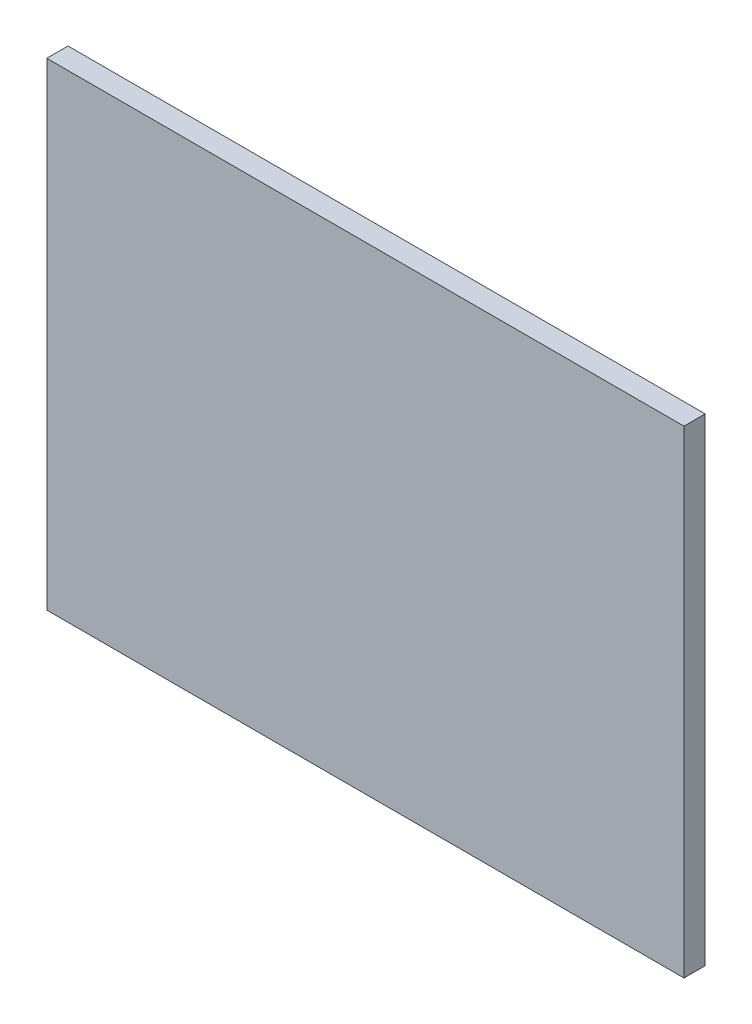
ISO-10303-21;
HEADER;
FILE_DESCRIPTION(('STEP AP214'),'2;1');
FILE_NAME('part.step','',(''),(''),'','','');
FILE_SCHEMA(('AUTOMOTIVE_DESIGN { 1 0 10303 214 1 1 1 1 }'));
ENDSEC;
DATA;
#1=APPLICATION_CONTEXT('core data for automotive mechanical design processes');
#2=APPLICATION_PROTOCOL_DEFINITION('international standard','automotive_design',2000,#1);
#3=PRODUCT_CONTEXT('',#1,'mechanical');
#4=PRODUCT('Part','Part','',(#3));
#5=PRODUCT_RELATED_PRODUCT_CATEGORY('part','',(#4));
#6=PRODUCT_DEFINITION_FORMATION('','',#4);
#7=PRODUCT_DEFINITION_CONTEXT('part definition',#1,'design');
#8=PRODUCT_DEFINITION('design','',#6,#7);
#9=PRODUCT_DEFINITION_SHAPE('','',#8);
#10=(LENGTH_UNIT() NAMED_UNIT(*) SI_UNIT(.MILLI.,.METRE.));
#11=(NAMED_UNIT(*) PLANE_ANGLE_UNIT() SI_UNIT($,.RADIAN.));
#12=(NAMED_UNIT(*) SI_UNIT($,.STERADIAN.) SOLID_ANGLE_UNIT());
#13=UNCERTAINTY_MEASURE_WITH_UNIT(LENGTH_MEASURE(1.E-05),#10,'distance_accuracy_value','');
#14=(GEOMETRIC_REPRESENTATION_CONTEXT(3) GLOBAL_UNCERTAINTY_ASSIGNED_CONTEXT((#13)) GLOBAL_UNIT_ASSIGNED_CONTEXT((#10,
#11,#12)) REPRESENTATION_CONTEXT('',''));
#15=CARTESIAN_POINT('',(0.,0.,0.));
#16=DIRECTION('',(0.,0.,1.));
#17=DIRECTION('',(1.,0.,0.));
#18=AXIS2_PLACEMENT_3D('',#15,#16,#17);
#19=CARTESIAN_POINT('',(0.,0.,0.));
#20=DIRECTION('',(1.,0.,0.));
#21=DIRECTION('',(0.,0.,1.));
#22=AXIS2_PLACEMENT_3D('',#19,#20,#21);
#23=PLANE('',#22);
#24=DIRECTION('',(0.,1.,0.));
#25=VECTOR('',#24,1.);
#26=CARTESIAN_POINT('',(0.,0.,0.06));
#27=LINE('',#26,#25);
#28=CARTESIAN_POINT('',(0.,0.,0.06));
#29=VERTEX_POINT('',#28);
#30=CARTESIAN_POINT('',(0.,1.35,0.06));
#31=VERTEX_POINT('',#30);
#32=EDGE_CURVE('E11',#29,#31,#27,.T.);
#33=ORIENTED_EDGE('',*,*,#32,.T.);
#34=DIRECTION('',(0.,0.,1.));
#35=VECTOR('',#34,1.);
#36=CARTESIAN_POINT('',(0.,1.35,0.));
#37=LINE('',#36,#35);
#38=CARTESIAN_POINT('',(0.,1.35,0.));
#39=VERTEX_POINT('',#38);
#40=EDGE_CURVE('E69',#39,#31,#37,.T.);
#41=ORIENTED_EDGE('',*,*,#40,.F.);
#42=DIRECTION('',(0.,1.,0.));
#43=VECTOR('',#42,1.);
#44=CARTESIAN_POINT('',(0.,0.,0.));
#45=LINE('',#44,#43);
#46=CARTESIAN_POINT('',(0.,0.,0.));
#47=VERTEX_POINT('',#46);
#48=EDGE_CURVE('E81',#47,#39,#45,.T.);
#49=ORIENTED_EDGE('',*,*,#48,.F.);
#50=DIRECTION('',(0.,0.,1.));
#51=VECTOR('',#50,1.);
#52=CARTESIAN_POINT('',(0.,0.,0.));
#53=LINE('',#52,#51);
#54=EDGE_CURVE('E64',#47,#29,#53,.T.);
#55=ORIENTED_EDGE('',*,*,#54,.T.);
#56=EDGE_LOOP('',(#33,#41,#49,#55));
#57=FACE_BOUND('',#56,.T.);
#58=ADVANCED_FACE('F17',(#57),#23,.F.);
#59=CARTESIAN_POINT('',(1.8,0.,0.));
#60=DIRECTION('',(1.,0.,0.));
#61=DIRECTION('',(0.,0.,1.));
#62=AXIS2_PLACEMENT_3D('',#59,#60,#61);
#63=PLANE('',#62);
#64=DIRECTION('',(0.,0.,1.));
#65=VECTOR('',#64,1.);
#66=CARTESIAN_POINT('',(1.8,0.,0.));
#67=LINE('',#66,#65);
#68=CARTESIAN_POINT('',(1.8,0.,0.));
#69=VERTEX_POINT('',#68);
#70=CARTESIAN_POINT('',(1.8,0.,0.06));
#71=VERTEX_POINT('',#70);
#72=EDGE_CURVE('E24',#69,#71,#67,.T.);
#73=ORIENTED_EDGE('',*,*,#72,.F.);
#74=DIRECTION('',(0.,1.,0.));
#75=VECTOR('',#74,1.);
#76=CARTESIAN_POINT('',(1.8,0.,0.));
#77=LINE('',#76,#75);
#78=CARTESIAN_POINT('',(1.8,1.35,0.));
#79=VERTEX_POINT('',#78);
#80=EDGE_CURVE('E59',#69,#79,#77,.T.);
#81=ORIENTED_EDGE('',*,*,#80,.T.);
#82=DIRECTION('',(0.,0.,1.));
#83=VECTOR('',#82,1.);
#84=CARTESIAN_POINT('',(1.8,1.35,0.));
#85=LINE('',#84,#83);
#86=CARTESIAN_POINT('',(1.8,1.35,0.06));
#87=VERTEX_POINT('',#86);
#88=EDGE_CURVE('E53',#79,#87,#85,.T.);
#89=ORIENTED_EDGE('',*,*,#88,.T.);
#90=DIRECTION('',(0.,1.,0.));
#91=VECTOR('',#90,1.);
#92=CARTESIAN_POINT('',(1.8,0.,0.06));
#93=LINE('',#92,#91);
#94=EDGE_CURVE('E57',#71,#87,#93,.T.);
#95=ORIENTED_EDGE('',*,*,#94,.F.);
#96=EDGE_LOOP('',(#73,#81,#89,#95));
#97=FACE_BOUND('',#96,.T.);
#98=ADVANCED_FACE('F55',(#97),#63,.T.);
#99=CARTESIAN_POINT('',(0.,0.,0.));
#100=DIRECTION('',(0.,1.,0.));
#101=DIRECTION('',(0.,0.,1.));
#102=AXIS2_PLACEMENT_3D('',#99,#100,#101);
#103=PLANE('',#102);
#104=ORIENTED_EDGE('',*,*,#72,.T.);
#105=DIRECTION('',(1.,0.,0.));
#106=VECTOR('',#105,1.);
#107=CARTESIAN_POINT('',(0.,0.,0.06));
#108=LINE('',#107,#106);
#109=EDGE_CURVE('E63',#29,#71,#108,.T.);
#110=ORIENTED_EDGE('',*,*,#109,.F.);
#111=ORIENTED_EDGE('',*,*,#54,.F.);
#112=DIRECTION('',(1.,0.,0.));
#113=VECTOR('',#112,1.);
#114=CARTESIAN_POINT('',(0.,0.,0.));
#115=LINE('',#114,#113);
#116=EDGE_CURVE('E71',#47,#69,#115,.T.);
#117=ORIENTED_EDGE('',*,*,#116,.T.);
#118=EDGE_LOOP('',(#104,#110,#111,#117));
#119=FACE_BOUND('',#118,.T.);
#120=ADVANCED_FACE('F87',(#119),#103,.F.);
#121=CARTESIAN_POINT('',(0.,1.35,0.));
#122=DIRECTION('',(0.,1.,0.));
#123=DIRECTION('',(0.,0.,1.));
#124=AXIS2_PLACEMENT_3D('',#121,#122,#123);
#125=PLANE('',#124);
#126=DIRECTION('',(1.,0.,0.));
#127=VECTOR('',#126,1.);
#128=CARTESIAN_POINT('',(0.,1.35,0.));
#129=LINE('',#128,#127);
#130=EDGE_CURVE('E79',#39,#79,#129,.T.);
#131=ORIENTED_EDGE('',*,*,#130,.F.);
#132=ORIENTED_EDGE('',*,*,#40,.T.);
#133=DIRECTION('',(1.,0.,0.));
#134=VECTOR('',#133,1.);
#135=CARTESIAN_POINT('',(0.,1.35,0.06));
#136=LINE('',#135,#134);
#137=EDGE_CURVE('E67',#31,#87,#136,.T.);
#138=ORIENTED_EDGE('',*,*,#137,.T.);
#139=ORIENTED_EDGE('',*,*,#88,.F.);
#140=EDGE_LOOP('',(#131,#132,#138,#139));
#141=FACE_BOUND('',#140,.T.);
#142=ADVANCED_FACE('F68',(#141),#125,.T.);
#143=CARTESIAN_POINT('',(0.,0.,0.));
#144=DIRECTION('',(0.,0.,1.));
#145=DIRECTION('',(1.,0.,0.));
#146=AXIS2_PLACEMENT_3D('',#143,#144,#145);
#147=PLANE('',#146);
#148=ORIENTED_EDGE('',*,*,#130,.T.);
#149=ORIENTED_EDGE('',*,*,#80,.F.);
#150=ORIENTED_EDGE('',*,*,#116,.F.);
#151=ORIENTED_EDGE('',*,*,#48,.T.);
#152=EDGE_LOOP('',(#148,#149,#150,#151));
#153=FACE_BOUND('',#152,.T.);
#154=ADVANCED_FACE('F91',(#153),#147,.F.);
#155=CARTESIAN_POINT('',(0.,0.,0.06));
#156=DIRECTION('',(0.,0.,1.));
#157=DIRECTION('',(1.,0.,0.));
#158=AXIS2_PLACEMENT_3D('',#155,#156,#157);
#159=PLANE('',#158);
#160=ORIENTED_EDGE('',*,*,#32,.F.);
#161=ORIENTED_EDGE('',*,*,#109,.T.);
#162=ORIENTED_EDGE('',*,*,#94,.T.);
#163=ORIENTED_EDGE('',*,*,#137,.F.);
#164=EDGE_LOOP('',(#160,#161,#162,#163));
#165=FACE_BOUND('',#164,.T.);
#166=ADVANCED_FACE('F73',(#165),#159,.T.);
#167=CLOSED_SHELL('',(#58,#98,#120,#142,#154,#166));
#168=MANIFOLD_SOLID_BREP('B1',#167);
#169=ADVANCED_BREP_SHAPE_REPRESENTATION('',(#18,#168),#14);
#170=SHAPE_DEFINITION_REPRESENTATION(#9,#169);
ENDSEC;
END-ISO-10303-21;
